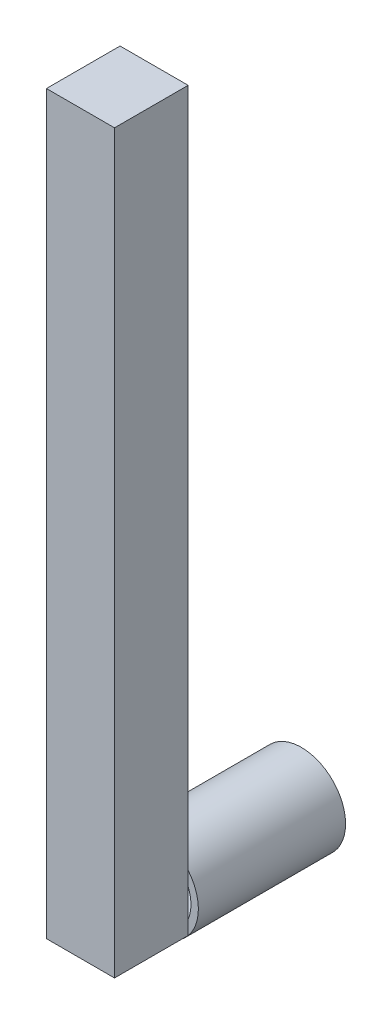
ISO-10303-21;
HEADER;
FILE_DESCRIPTION(('STEP AP214'),'2;1');
FILE_NAME('part.step','',(''),(''),'','','');
FILE_SCHEMA(('AUTOMOTIVE_DESIGN { 1 0 10303 214 1 1 1 1 }'));
ENDSEC;
DATA;
#1=APPLICATION_CONTEXT('core data for automotive mechanical design processes');
#2=APPLICATION_PROTOCOL_DEFINITION('international standard','automotive_design',2000,#1);
#3=PRODUCT_CONTEXT('',#1,'mechanical');
#4=PRODUCT('Part','Part','',(#3));
#5=PRODUCT_RELATED_PRODUCT_CATEGORY('part','',(#4));
#6=PRODUCT_DEFINITION_FORMATION('','',#4);
#7=PRODUCT_DEFINITION_CONTEXT('part definition',#1,'design');
#8=PRODUCT_DEFINITION('design','',#6,#7);
#9=PRODUCT_DEFINITION_SHAPE('','',#8);
#10=(LENGTH_UNIT() NAMED_UNIT(*) SI_UNIT(.MILLI.,.METRE.));
#11=(NAMED_UNIT(*) PLANE_ANGLE_UNIT() SI_UNIT($,.RADIAN.));
#12=(NAMED_UNIT(*) SI_UNIT($,.STERADIAN.) SOLID_ANGLE_UNIT());
#13=UNCERTAINTY_MEASURE_WITH_UNIT(LENGTH_MEASURE(1.E-05),#10,'distance_accuracy_value','');
#14=(GEOMETRIC_REPRESENTATION_CONTEXT(3) GLOBAL_UNCERTAINTY_ASSIGNED_CONTEXT((#13)) GLOBAL_UNIT_ASSIGNED_CONTEXT((#10,
#11,#12)) REPRESENTATION_CONTEXT('',''));
#15=CARTESIAN_POINT('',(0.,0.,0.));
#16=DIRECTION('',(0.,0.,1.));
#17=DIRECTION('',(1.,0.,0.));
#18=AXIS2_PLACEMENT_3D('',#15,#16,#17);
#19=CARTESIAN_POINT('',(0.,0.,10.));
#20=DIRECTION('',(0.,0.,1.));
#21=DIRECTION('',(1.,0.,0.));
#22=AXIS2_PLACEMENT_3D('',#19,#20,#21);
#23=PLANE('',#22);
#24=DIRECTION('',(0.,-1.,0.));
#25=VECTOR('',#24,1.);
#26=CARTESIAN_POINT('',(-2.31352092192488,-1.90987458850466,10.));
#27=LINE('',#26,#25);
#28=CARTESIAN_POINT('',(-2.31352092192488,1.90987458850466,10.));
#29=VERTEX_POINT('',#28);
#30=CARTESIAN_POINT('',(-2.31352092192488,0.94742859562916,10.));
#31=VERTEX_POINT('',#30);
#32=EDGE_CURVE('E11',#29,#31,#27,.T.);
#33=ORIENTED_EDGE('',*,*,#32,.F.);
#34=CARTESIAN_POINT('',(0.,0.,10.));
#35=DIRECTION('',(0.,0.,1.));
#36=DIRECTION('',(1.,0.,0.));
#37=AXIS2_PLACEMENT_3D('',#34,#35,#36);
#38=CIRCLE('',#37,3.);
#39=CARTESIAN_POINT('',(-2.31352092192488,-1.90987458850466,10.));
#40=VERTEX_POINT('',#39);
#41=EDGE_CURVE('E159',#29,#40,#38,.T.);
#42=ORIENTED_EDGE('',*,*,#41,.T.);
#43=CARTESIAN_POINT('',(-2.31352092192488,-0.94742859562916,10.));
#44=VERTEX_POINT('',#43);
#45=EDGE_CURVE('E55',#44,#40,#27,.T.);
#46=ORIENTED_EDGE('',*,*,#45,.F.);
#47=CARTESIAN_POINT('',(0.,0.,10.));
#48=DIRECTION('',(0.,0.,1.));
#49=DIRECTION('',(1.,0.,0.));
#50=AXIS2_PLACEMENT_3D('',#47,#48,#49);
#51=CIRCLE('',#50,2.5);
#52=EDGE_CURVE('E155',#31,#44,#51,.T.);
#53=ORIENTED_EDGE('',*,*,#52,.F.);
#54=EDGE_LOOP('',(#33,#42,#46,#53));
#55=FACE_BOUND('',#54,.T.);
#56=ADVANCED_FACE('F43',(#55),#23,.T.);
#57=DIRECTION('',(0.,1.,0.));
#58=VECTOR('',#57,1.);
#59=CARTESIAN_POINT('',(2.30945072399918,-1.90987458850466,10.));
#60=LINE('',#59,#58);
#61=CARTESIAN_POINT('',(2.30945072399918,0.957307345328382,10.));
#62=VERTEX_POINT('',#61);
#63=CARTESIAN_POINT('',(2.30945072399918,1.91479433710769,10.));
#64=VERTEX_POINT('',#63);
#65=EDGE_CURVE('E53',#62,#64,#60,.T.);
#66=ORIENTED_EDGE('',*,*,#65,.F.);
#67=CARTESIAN_POINT('',(2.30945072399918,-0.957307345328382,10.));
#68=VERTEX_POINT('',#67);
#69=EDGE_CURVE('E63',#68,#62,#51,.T.);
#70=ORIENTED_EDGE('',*,*,#69,.F.);
#71=CARTESIAN_POINT('',(2.30945072399918,-1.90987458850466,10.));
#72=VERTEX_POINT('',#71);
#73=EDGE_CURVE('E219',#72,#68,#60,.T.);
#74=ORIENTED_EDGE('',*,*,#73,.F.);
#75=DIRECTION('',(1.,0.,0.));
#76=VECTOR('',#75,1.);
#77=CARTESIAN_POINT('',(-2.31352092192488,-1.90987458850466,10.));
#78=LINE('',#77,#76);
#79=CARTESIAN_POINT('',(1.61318909498674,-1.90987458850466,10.));
#80=VERTEX_POINT('',#79);
#81=EDGE_CURVE('E69',#80,#72,#78,.T.);
#82=ORIENTED_EDGE('',*,*,#81,.F.);
#83=CARTESIAN_POINT('',(-1.61318909498674,-1.90987458850466,10.));
#84=VERTEX_POINT('',#83);
#85=EDGE_CURVE('E234',#84,#80,#51,.T.);
#86=ORIENTED_EDGE('',*,*,#85,.F.);
#87=EDGE_CURVE('E167',#40,#84,#78,.T.);
#88=ORIENTED_EDGE('',*,*,#87,.F.);
#89=EDGE_CURVE('E160',#40,#64,#38,.T.);
#90=ORIENTED_EDGE('',*,*,#89,.T.);
#91=EDGE_LOOP('',(#66,#70,#74,#82,#86,#88,#90));
#92=FACE_BOUND('',#91,.T.);
#93=ADVANCED_FACE('F181',(#92),#23,.T.);
#94=CARTESIAN_POINT('',(0.,0.,0.));
#95=DIRECTION('',(0.,0.,1.));
#96=DIRECTION('',(1.,0.,0.));
#97=AXIS2_PLACEMENT_3D('',#94,#95,#96);
#98=PLANE('',#97);
#99=CARTESIAN_POINT('',(0.,0.,0.));
#100=DIRECTION('',(0.,0.,1.));
#101=DIRECTION('',(1.,0.,0.));
#102=AXIS2_PLACEMENT_3D('',#99,#100,#101);
#103=CIRCLE('',#102,3.);
#104=CARTESIAN_POINT('',(3.,0.,0.));
#105=VERTEX_POINT('',#104);
#106=EDGE_CURVE('E47',#105,#105,#103,.T.);
#107=ORIENTED_EDGE('',*,*,#106,.F.);
#108=EDGE_LOOP('',(#107));
#109=FACE_BOUND('',#108,.T.);
#110=CARTESIAN_POINT('',(0.,0.,0.));
#111=DIRECTION('',(0.,0.,1.));
#112=DIRECTION('',(1.,0.,0.));
#113=AXIS2_PLACEMENT_3D('',#110,#111,#112);
#114=CIRCLE('',#113,2.5);
#115=CARTESIAN_POINT('',(2.5,0.,0.));
#116=VERTEX_POINT('',#115);
#117=EDGE_CURVE('E142',#116,#116,#114,.T.);
#118=ORIENTED_EDGE('',*,*,#117,.T.);
#119=EDGE_LOOP('',(#118));
#120=FACE_BOUND('',#119,.T.);
#121=ADVANCED_FACE('F178',(#109,#120),#98,.F.);
#122=CARTESIAN_POINT('',(0.,0.,10.));
#123=DIRECTION('',(0.,0.,-1.));
#124=DIRECTION('',(-1.,0.,0.));
#125=AXIS2_PLACEMENT_3D('',#122,#123,#124);
#126=CYLINDRICAL_SURFACE('',#125,3.);
#127=EDGE_CURVE('E156',#64,#29,#38,.T.);
#128=ORIENTED_EDGE('',*,*,#127,.F.);
#129=ORIENTED_EDGE('',*,*,#89,.F.);
#130=ORIENTED_EDGE('',*,*,#41,.F.);
#131=EDGE_LOOP('',(#128,#129,#130));
#132=FACE_BOUND('',#131,.T.);
#133=ORIENTED_EDGE('',*,*,#106,.T.);
#134=EDGE_LOOP('',(#133));
#135=FACE_BOUND('',#134,.T.);
#136=ADVANCED_FACE('F45',(#132,#135),#126,.T.);
#137=CARTESIAN_POINT('',(0.,0.,10.));
#138=DIRECTION('',(0.,0.,-1.));
#139=DIRECTION('',(-1.,0.,0.));
#140=AXIS2_PLACEMENT_3D('',#137,#138,#139);
#141=CYLINDRICAL_SURFACE('',#140,2.5);
#142=EDGE_CURVE('E152',#62,#31,#51,.T.);
#143=ORIENTED_EDGE('',*,*,#142,.T.);
#144=ORIENTED_EDGE('',*,*,#52,.T.);
#145=EDGE_CURVE('E237',#44,#84,#51,.T.);
#146=ORIENTED_EDGE('',*,*,#145,.T.);
#147=ORIENTED_EDGE('',*,*,#85,.T.);
#148=EDGE_CURVE('E238',#80,#68,#51,.T.);
#149=ORIENTED_EDGE('',*,*,#148,.T.);
#150=ORIENTED_EDGE('',*,*,#69,.T.);
#151=EDGE_LOOP('',(#143,#144,#146,#147,#149,#150));
#152=FACE_BOUND('',#151,.T.);
#153=ORIENTED_EDGE('',*,*,#117,.F.);
#154=EDGE_LOOP('',(#153));
#155=FACE_BOUND('',#154,.T.);
#156=ADVANCED_FACE('F184',(#152,#155),#141,.F.);
#157=CARTESIAN_POINT('',(0.,0.,10.));
#158=DIRECTION('',(0.,0.,-1.));
#159=DIRECTION('',(-1.,0.,0.));
#160=AXIS2_PLACEMENT_3D('',#157,#158,#159);
#161=PLANE('',#160);
#162=ORIENTED_EDGE('',*,*,#142,.F.);
#163=EDGE_CURVE('E220',#68,#62,#60,.T.);
#164=ORIENTED_EDGE('',*,*,#163,.F.);
#165=ORIENTED_EDGE('',*,*,#148,.F.);
#166=EDGE_CURVE('E168',#84,#80,#78,.T.);
#167=ORIENTED_EDGE('',*,*,#166,.F.);
#168=ORIENTED_EDGE('',*,*,#145,.F.);
#169=EDGE_CURVE('E56',#31,#44,#27,.T.);
#170=ORIENTED_EDGE('',*,*,#169,.F.);
#171=EDGE_LOOP('',(#162,#164,#165,#167,#168,#170));
#172=FACE_BOUND('',#171,.T.);
#173=ADVANCED_FACE('F186',(#172),#161,.T.);
#174=CARTESIAN_POINT('',(2.30945072399918,48.0901254114953,10.));
#175=VERTEX_POINT('',#174);
#176=EDGE_CURVE('E226',#64,#175,#60,.T.);
#177=ORIENTED_EDGE('',*,*,#176,.F.);
#178=ORIENTED_EDGE('',*,*,#127,.T.);
#179=CARTESIAN_POINT('',(-2.31352092192488,48.0901254114953,10.));
#180=VERTEX_POINT('',#179);
#181=EDGE_CURVE('E207',#180,#29,#27,.T.);
#182=ORIENTED_EDGE('',*,*,#181,.F.);
#183=DIRECTION('',(-1.,0.,0.));
#184=VECTOR('',#183,1.);
#185=CARTESIAN_POINT('',(-2.31352092192488,48.0901254114953,10.));
#186=LINE('',#185,#184);
#187=EDGE_CURVE('E135',#175,#180,#186,.T.);
#188=ORIENTED_EDGE('',*,*,#187,.F.);
#189=EDGE_LOOP('',(#177,#178,#182,#188));
#190=FACE_BOUND('',#189,.T.);
#191=ADVANCED_FACE('F193',(#190),#161,.T.);
#192=CARTESIAN_POINT('',(-2.31352092192488,-1.90987458850466,15.));
#193=DIRECTION('',(1.,0.,0.));
#194=DIRECTION('',(0.,1.,0.));
#195=AXIS2_PLACEMENT_3D('',#192,#193,#194);
#196=PLANE('',#195);
#197=ORIENTED_EDGE('',*,*,#181,.T.);
#198=ORIENTED_EDGE('',*,*,#32,.T.);
#199=ORIENTED_EDGE('',*,*,#169,.T.);
#200=ORIENTED_EDGE('',*,*,#45,.T.);
#201=DIRECTION('',(0.,0.,-1.));
#202=VECTOR('',#201,1.);
#203=CARTESIAN_POINT('',(-2.31352092192488,-1.90987458850466,15.));
#204=LINE('',#203,#202);
#205=CARTESIAN_POINT('',(-2.31352092192488,-1.90987458850466,15.));
#206=VERTEX_POINT('',#205);
#207=EDGE_CURVE('E118',#206,#40,#204,.T.);
#208=ORIENTED_EDGE('',*,*,#207,.F.);
#209=DIRECTION('',(0.,-1.,0.));
#210=VECTOR('',#209,1.);
#211=CARTESIAN_POINT('',(-2.31352092192488,-1.90987458850466,15.));
#212=LINE('',#211,#210);
#213=CARTESIAN_POINT('',(-2.31352092192488,48.0901254114953,15.));
#214=VERTEX_POINT('',#213);
#215=EDGE_CURVE('E125',#214,#206,#212,.T.);
#216=ORIENTED_EDGE('',*,*,#215,.F.);
#217=DIRECTION('',(0.,0.,-1.));
#218=VECTOR('',#217,1.);
#219=CARTESIAN_POINT('',(-2.31352092192488,48.0901254114953,15.));
#220=LINE('',#219,#218);
#221=EDGE_CURVE('E208',#214,#180,#220,.T.);
#222=ORIENTED_EDGE('',*,*,#221,.T.);
#223=EDGE_LOOP('',(#197,#198,#199,#200,#208,#216,#222));
#224=FACE_BOUND('',#223,.T.);
#225=ADVANCED_FACE('F139',(#224),#196,.F.);
#226=CARTESIAN_POINT('',(-2.31352092192488,-1.90987458850466,15.));
#227=DIRECTION('',(0.,1.,0.));
#228=DIRECTION('',(0.,0.,1.));
#229=AXIS2_PLACEMENT_3D('',#226,#227,#228);
#230=PLANE('',#229);
#231=ORIENTED_EDGE('',*,*,#87,.T.);
#232=ORIENTED_EDGE('',*,*,#166,.T.);
#233=ORIENTED_EDGE('',*,*,#81,.T.);
#234=DIRECTION('',(0.,0.,-1.));
#235=VECTOR('',#234,1.);
#236=CARTESIAN_POINT('',(2.30945072399918,-1.90987458850466,15.));
#237=LINE('',#236,#235);
#238=CARTESIAN_POINT('',(2.30945072399918,-1.90987458850466,15.));
#239=VERTEX_POINT('',#238);
#240=EDGE_CURVE('E120',#239,#72,#237,.T.);
#241=ORIENTED_EDGE('',*,*,#240,.F.);
#242=DIRECTION('',(1.,0.,0.));
#243=VECTOR('',#242,1.);
#244=CARTESIAN_POINT('',(-2.31352092192488,-1.90987458850466,15.));
#245=LINE('',#244,#243);
#246=EDGE_CURVE('E113',#206,#239,#245,.T.);
#247=ORIENTED_EDGE('',*,*,#246,.F.);
#248=ORIENTED_EDGE('',*,*,#207,.T.);
#249=EDGE_LOOP('',(#231,#232,#233,#241,#247,#248));
#250=FACE_BOUND('',#249,.T.);
#251=ADVANCED_FACE('F116',(#250),#230,.F.);
#252=CARTESIAN_POINT('',(2.30945072399918,-1.90987458850466,15.));
#253=DIRECTION('',(-1.,0.,0.));
#254=DIRECTION('',(0.,0.,1.));
#255=AXIS2_PLACEMENT_3D('',#252,#253,#254);
#256=PLANE('',#255);
#257=ORIENTED_EDGE('',*,*,#73,.T.);
#258=ORIENTED_EDGE('',*,*,#163,.T.);
#259=ORIENTED_EDGE('',*,*,#65,.T.);
#260=ORIENTED_EDGE('',*,*,#176,.T.);
#261=DIRECTION('',(0.,0.,-1.));
#262=VECTOR('',#261,1.);
#263=CARTESIAN_POINT('',(2.30945072399918,48.0901254114953,15.));
#264=LINE('',#263,#262);
#265=CARTESIAN_POINT('',(2.30945072399918,48.0901254114953,15.));
#266=VERTEX_POINT('',#265);
#267=EDGE_CURVE('E148',#266,#175,#264,.T.);
#268=ORIENTED_EDGE('',*,*,#267,.F.);
#269=DIRECTION('',(0.,1.,0.));
#270=VECTOR('',#269,1.);
#271=CARTESIAN_POINT('',(2.30945072399918,-1.90987458850466,15.));
#272=LINE('',#271,#270);
#273=EDGE_CURVE('E124',#239,#266,#272,.T.);
#274=ORIENTED_EDGE('',*,*,#273,.F.);
#275=ORIENTED_EDGE('',*,*,#240,.T.);
#276=EDGE_LOOP('',(#257,#258,#259,#260,#268,#274,#275));
#277=FACE_BOUND('',#276,.T.);
#278=ADVANCED_FACE('F245',(#277),#256,.F.);
#279=CARTESIAN_POINT('',(-2.31352092192488,48.0901254114953,15.));
#280=DIRECTION('',(0.,-1.,0.));
#281=DIRECTION('',(0.,0.,-1.));
#282=AXIS2_PLACEMENT_3D('',#279,#280,#281);
#283=PLANE('',#282);
#284=ORIENTED_EDGE('',*,*,#187,.T.);
#285=ORIENTED_EDGE('',*,*,#221,.F.);
#286=DIRECTION('',(-1.,0.,0.));
#287=VECTOR('',#286,1.);
#288=CARTESIAN_POINT('',(-2.31352092192488,48.0901254114953,15.));
#289=LINE('',#288,#287);
#290=EDGE_CURVE('E130',#266,#214,#289,.T.);
#291=ORIENTED_EDGE('',*,*,#290,.F.);
#292=ORIENTED_EDGE('',*,*,#267,.T.);
#293=EDGE_LOOP('',(#284,#285,#291,#292));
#294=FACE_BOUND('',#293,.T.);
#295=ADVANCED_FACE('F254',(#294),#283,.F.);
#296=CARTESIAN_POINT('',(0.,0.,15.));
#297=DIRECTION('',(0.,0.,-1.));
#298=DIRECTION('',(-1.,0.,0.));
#299=AXIS2_PLACEMENT_3D('',#296,#297,#298);
#300=PLANE('',#299);
#301=ORIENTED_EDGE('',*,*,#215,.T.);
#302=ORIENTED_EDGE('',*,*,#246,.T.);
#303=ORIENTED_EDGE('',*,*,#273,.T.);
#304=ORIENTED_EDGE('',*,*,#290,.T.);
#305=EDGE_LOOP('',(#301,#302,#303,#304));
#306=FACE_BOUND('',#305,.T.);
#307=ADVANCED_FACE('F128',(#306),#300,.F.);
#308=CLOSED_SHELL('',(#56,#93,#121,#136,#156,#173,#191,#225,#251,#278,#295,#307));
#309=MANIFOLD_SOLID_BREP('B2',#308);
#310=ADVANCED_BREP_SHAPE_REPRESENTATION('',(#18,#309),#14);
#311=SHAPE_DEFINITION_REPRESENTATION(#9,#310);
ENDSEC;
END-ISO-10303-21;
